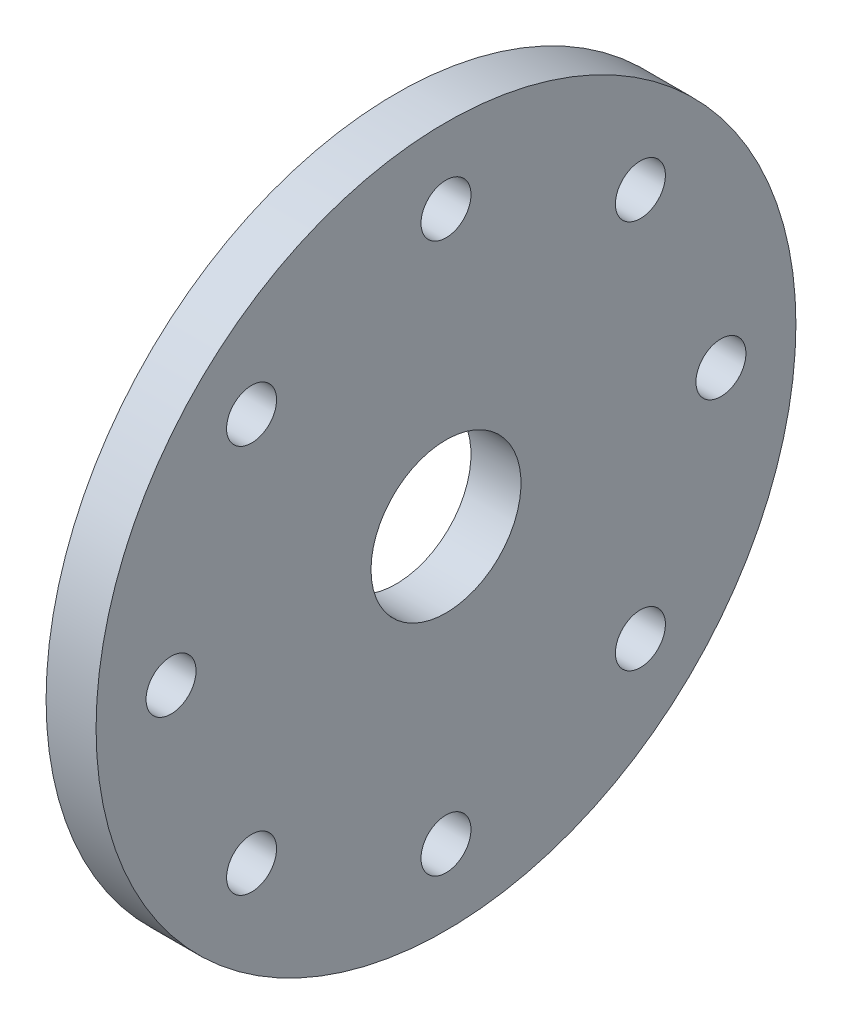
ISO-10303-21;
HEADER;
FILE_DESCRIPTION(('STEP AP214'),'2;1');
FILE_NAME('part.step','',(''),(''),'','','');
FILE_SCHEMA(('AUTOMOTIVE_DESIGN { 1 0 10303 214 1 1 1 1 }'));
ENDSEC;
DATA;
#1=APPLICATION_CONTEXT('core data for automotive mechanical design processes');
#2=APPLICATION_PROTOCOL_DEFINITION('international standard','automotive_design',2000,#1);
#3=PRODUCT_CONTEXT('',#1,'mechanical');
#4=PRODUCT('Part','Part','',(#3));
#5=PRODUCT_RELATED_PRODUCT_CATEGORY('part','',(#4));
#6=PRODUCT_DEFINITION_FORMATION('','',#4);
#7=PRODUCT_DEFINITION_CONTEXT('part definition',#1,'design');
#8=PRODUCT_DEFINITION('design','',#6,#7);
#9=PRODUCT_DEFINITION_SHAPE('','',#8);
#10=(LENGTH_UNIT() NAMED_UNIT(*) SI_UNIT(.MILLI.,.METRE.));
#11=(NAMED_UNIT(*) PLANE_ANGLE_UNIT() SI_UNIT($,.RADIAN.));
#12=(NAMED_UNIT(*) SI_UNIT($,.STERADIAN.) SOLID_ANGLE_UNIT());
#13=UNCERTAINTY_MEASURE_WITH_UNIT(LENGTH_MEASURE(1.E-05),#10,'distance_accuracy_value','');
#14=(GEOMETRIC_REPRESENTATION_CONTEXT(3) GLOBAL_UNCERTAINTY_ASSIGNED_CONTEXT((#13)) GLOBAL_UNIT_ASSIGNED_CONTEXT((#10,
#11,#12)) REPRESENTATION_CONTEXT('',''));
#15=CARTESIAN_POINT('',(0.,0.,0.));
#16=DIRECTION('',(0.,0.,1.));
#17=DIRECTION('',(1.,0.,0.));
#18=AXIS2_PLACEMENT_3D('',#15,#16,#17);
#19=CARTESIAN_POINT('',(-2.,3.,0.));
#20=DIRECTION('',(1.,0.,0.));
#21=DIRECTION('',(0.,0.,-1.));
#22=AXIS2_PLACEMENT_3D('',#19,#20,#21);
#23=PLANE('',#22);
#24=CARTESIAN_POINT('',(-2.,7.77817459305212,7.77817459305193));
#25=DIRECTION('',(1.,0.,0.));
#26=DIRECTION('',(0.,0.707106781186539,-0.707106781186556));
#27=AXIS2_PLACEMENT_3D('',#24,#25,#26);
#28=CIRCLE('',#27,1.);
#29=CARTESIAN_POINT('',(-2.,8.48528137423866,7.07106781186537));
#30=VERTEX_POINT('',#29);
#31=EDGE_CURVE('E73',#30,#30,#28,.T.);
#32=ORIENTED_EDGE('',*,*,#31,.T.);
#33=EDGE_LOOP('',(#32));
#34=FACE_BOUND('',#33,.T.);
#35=CARTESIAN_POINT('',(-2.,1.15218884181823E-13,11.));
#36=DIRECTION('',(1.,0.,0.));
#37=DIRECTION('',(0.,1.,0.));
#38=AXIS2_PLACEMENT_3D('',#35,#36,#37);
#39=CIRCLE('',#38,1.);
#40=CARTESIAN_POINT('',(-2.,1.00000000000012,11.));
#41=VERTEX_POINT('',#40);
#42=EDGE_CURVE('E67',#41,#41,#39,.T.);
#43=ORIENTED_EDGE('',*,*,#42,.T.);
#44=EDGE_LOOP('',(#43));
#45=FACE_BOUND('',#44,.T.);
#46=CARTESIAN_POINT('',(-2.,-7.77817459305195,7.77817459305209));
#47=DIRECTION('',(1.,0.,0.));
#48=DIRECTION('',(0.,0.707106781186554,0.707106781186541));
#49=AXIS2_PLACEMENT_3D('',#46,#47,#48);
#50=CIRCLE('',#49,1.);
#51=CARTESIAN_POINT('',(-2.,-7.0710678118654,8.48528137423863));
#52=VERTEX_POINT('',#51);
#53=EDGE_CURVE('E61',#52,#52,#50,.T.);
#54=ORIENTED_EDGE('',*,*,#53,.T.);
#55=EDGE_LOOP('',(#54));
#56=FACE_BOUND('',#55,.T.);
#57=CARTESIAN_POINT('',(-2.,-11.,0.));
#58=DIRECTION('',(1.,0.,0.));
#59=DIRECTION('',(0.,0.,1.));
#60=AXIS2_PLACEMENT_3D('',#57,#58,#59);
#61=CIRCLE('',#60,1.);
#62=CARTESIAN_POINT('',(-2.,-11.,1.));
#63=VERTEX_POINT('',#62);
#64=EDGE_CURVE('E55',#63,#63,#61,.T.);
#65=ORIENTED_EDGE('',*,*,#64,.T.);
#66=EDGE_LOOP('',(#65));
#67=FACE_BOUND('',#66,.T.);
#68=CARTESIAN_POINT('',(-2.,-7.77817459305206,-7.77817459305198));
#69=DIRECTION('',(1.,0.,0.));
#70=DIRECTION('',(0.,-0.707106781186544,0.707106781186551));
#71=AXIS2_PLACEMENT_3D('',#68,#69,#70);
#72=CIRCLE('',#71,1.);
#73=CARTESIAN_POINT('',(-2.,-8.48528137423861,-7.07106781186543));
#74=VERTEX_POINT('',#73);
#75=EDGE_CURVE('E49',#74,#74,#72,.T.);
#76=ORIENTED_EDGE('',*,*,#75,.T.);
#77=EDGE_LOOP('',(#76));
#78=FACE_BOUND('',#77,.T.);
#79=CARTESIAN_POINT('',(-2.,0.,-11.));
#80=DIRECTION('',(1.,0.,0.));
#81=DIRECTION('',(0.,-1.,0.));
#82=AXIS2_PLACEMENT_3D('',#79,#80,#81);
#83=CIRCLE('',#82,1.);
#84=CARTESIAN_POINT('',(-2.,-1.00000000000004,-11.));
#85=VERTEX_POINT('',#84);
#86=EDGE_CURVE('E43',#85,#85,#83,.T.);
#87=ORIENTED_EDGE('',*,*,#86,.T.);
#88=EDGE_LOOP('',(#87));
#89=FACE_BOUND('',#88,.T.);
#90=CARTESIAN_POINT('',(-2.,7.77817459305201,-7.77817459305204));
#91=DIRECTION('',(1.,0.,0.));
#92=DIRECTION('',(0.,-0.707106781186549,-0.707106781186546));
#93=AXIS2_PLACEMENT_3D('',#90,#91,#92);
#94=CIRCLE('',#93,1.);
#95=CARTESIAN_POINT('',(-2.,7.07106781186546,-8.48528137423859));
#96=VERTEX_POINT('',#95);
#97=EDGE_CURVE('E37',#96,#96,#94,.T.);
#98=ORIENTED_EDGE('',*,*,#97,.T.);
#99=EDGE_LOOP('',(#98));
#100=FACE_BOUND('',#99,.T.);
#101=CARTESIAN_POINT('',(-2.,11.,0.));
#102=DIRECTION('',(1.,0.,0.));
#103=DIRECTION('',(0.,0.,-1.));
#104=AXIS2_PLACEMENT_3D('',#101,#102,#103);
#105=CIRCLE('',#104,1.);
#106=CARTESIAN_POINT('',(-2.,11.,-1.));
#107=VERTEX_POINT('',#106);
#108=EDGE_CURVE('E33',#107,#107,#105,.T.);
#109=ORIENTED_EDGE('',*,*,#108,.T.);
#110=EDGE_LOOP('',(#109));
#111=FACE_BOUND('',#110,.T.);
#112=CARTESIAN_POINT('',(-2.,0.,0.));
#113=DIRECTION('',(-1.,0.,0.));
#114=DIRECTION('',(0.,0.,1.));
#115=AXIS2_PLACEMENT_3D('',#112,#113,#114);
#116=CIRCLE('',#115,3.);
#117=CARTESIAN_POINT('',(-2.,0.,3.));
#118=VERTEX_POINT('',#117);
#119=EDGE_CURVE('E28',#118,#118,#116,.T.);
#120=ORIENTED_EDGE('',*,*,#119,.F.);
#121=EDGE_LOOP('',(#120));
#122=FACE_BOUND('',#121,.T.);
#123=CARTESIAN_POINT('',(-2.,0.,0.));
#124=DIRECTION('',(-1.,0.,0.));
#125=DIRECTION('',(0.,0.,1.));
#126=AXIS2_PLACEMENT_3D('',#123,#124,#125);
#127=CIRCLE('',#126,14.);
#128=CARTESIAN_POINT('',(-2.,0.,14.));
#129=VERTEX_POINT('',#128);
#130=EDGE_CURVE('E10',#129,#129,#127,.T.);
#131=ORIENTED_EDGE('',*,*,#130,.T.);
#132=EDGE_LOOP('',(#131));
#133=FACE_BOUND('',#132,.T.);
#134=ADVANCED_FACE('F14',(#34,#45,#56,#67,#78,#89,#100,#111,#122,#133),#23,.F.);
#135=CARTESIAN_POINT('',(0.,0.,0.));
#136=DIRECTION('',(-1.,0.,0.));
#137=DIRECTION('',(0.,0.,1.));
#138=AXIS2_PLACEMENT_3D('',#135,#136,#137);
#139=CYLINDRICAL_SURFACE('',#138,14.);
#140=ORIENTED_EDGE('',*,*,#130,.F.);
#141=EDGE_LOOP('',(#140));
#142=FACE_BOUND('',#141,.T.);
#143=CARTESIAN_POINT('',(0.,0.,0.));
#144=DIRECTION('',(-1.,0.,0.));
#145=DIRECTION('',(0.,0.,1.));
#146=AXIS2_PLACEMENT_3D('',#143,#144,#145);
#147=CIRCLE('',#146,14.);
#148=CARTESIAN_POINT('',(0.,0.,14.));
#149=VERTEX_POINT('',#148);
#150=EDGE_CURVE('E20',#149,#149,#147,.T.);
#151=ORIENTED_EDGE('',*,*,#150,.T.);
#152=EDGE_LOOP('',(#151));
#153=FACE_BOUND('',#152,.T.);
#154=ADVANCED_FACE('F95',(#142,#153),#139,.T.);
#155=CARTESIAN_POINT('',(0.,14.,0.));
#156=DIRECTION('',(-1.,0.,0.));
#157=DIRECTION('',(0.,0.,1.));
#158=AXIS2_PLACEMENT_3D('',#155,#156,#157);
#159=PLANE('',#158);
#160=CARTESIAN_POINT('',(0.,7.77817459305212,7.77817459305193));
#161=DIRECTION('',(1.,0.,0.));
#162=DIRECTION('',(0.,0.707106781186539,-0.707106781186556));
#163=AXIS2_PLACEMENT_3D('',#160,#161,#162);
#164=CIRCLE('',#163,1.);
#165=CARTESIAN_POINT('',(0.,8.48528137423866,7.07106781186537));
#166=VERTEX_POINT('',#165);
#167=EDGE_CURVE('E76',#166,#166,#164,.T.);
#168=ORIENTED_EDGE('',*,*,#167,.F.);
#169=EDGE_LOOP('',(#168));
#170=FACE_BOUND('',#169,.T.);
#171=CARTESIAN_POINT('',(0.,1.15218884181823E-13,11.));
#172=DIRECTION('',(1.,0.,0.));
#173=DIRECTION('',(0.,1.,0.));
#174=AXIS2_PLACEMENT_3D('',#171,#172,#173);
#175=CIRCLE('',#174,1.);
#176=CARTESIAN_POINT('',(0.,1.00000000000012,11.));
#177=VERTEX_POINT('',#176);
#178=EDGE_CURVE('E70',#177,#177,#175,.T.);
#179=ORIENTED_EDGE('',*,*,#178,.F.);
#180=EDGE_LOOP('',(#179));
#181=FACE_BOUND('',#180,.T.);
#182=CARTESIAN_POINT('',(0.,-7.77817459305195,7.77817459305209));
#183=DIRECTION('',(1.,0.,0.));
#184=DIRECTION('',(0.,0.707106781186554,0.707106781186541));
#185=AXIS2_PLACEMENT_3D('',#182,#183,#184);
#186=CIRCLE('',#185,1.);
#187=CARTESIAN_POINT('',(0.,-7.0710678118654,8.48528137423863));
#188=VERTEX_POINT('',#187);
#189=EDGE_CURVE('E64',#188,#188,#186,.T.);
#190=ORIENTED_EDGE('',*,*,#189,.F.);
#191=EDGE_LOOP('',(#190));
#192=FACE_BOUND('',#191,.T.);
#193=CARTESIAN_POINT('',(0.,-11.,0.));
#194=DIRECTION('',(1.,0.,0.));
#195=DIRECTION('',(0.,0.,1.));
#196=AXIS2_PLACEMENT_3D('',#193,#194,#195);
#197=CIRCLE('',#196,1.);
#198=CARTESIAN_POINT('',(0.,-11.,1.));
#199=VERTEX_POINT('',#198);
#200=EDGE_CURVE('E58',#199,#199,#197,.T.);
#201=ORIENTED_EDGE('',*,*,#200,.F.);
#202=EDGE_LOOP('',(#201));
#203=FACE_BOUND('',#202,.T.);
#204=CARTESIAN_POINT('',(0.,-7.77817459305206,-7.77817459305198));
#205=DIRECTION('',(1.,0.,0.));
#206=DIRECTION('',(0.,-0.707106781186544,0.707106781186551));
#207=AXIS2_PLACEMENT_3D('',#204,#205,#206);
#208=CIRCLE('',#207,1.);
#209=CARTESIAN_POINT('',(0.,-8.48528137423861,-7.07106781186543));
#210=VERTEX_POINT('',#209);
#211=EDGE_CURVE('E52',#210,#210,#208,.T.);
#212=ORIENTED_EDGE('',*,*,#211,.F.);
#213=EDGE_LOOP('',(#212));
#214=FACE_BOUND('',#213,.T.);
#215=CARTESIAN_POINT('',(0.,0.,-11.));
#216=DIRECTION('',(1.,0.,0.));
#217=DIRECTION('',(0.,-1.,0.));
#218=AXIS2_PLACEMENT_3D('',#215,#216,#217);
#219=CIRCLE('',#218,1.);
#220=CARTESIAN_POINT('',(0.,-1.00000000000004,-11.));
#221=VERTEX_POINT('',#220);
#222=EDGE_CURVE('E46',#221,#221,#219,.T.);
#223=ORIENTED_EDGE('',*,*,#222,.F.);
#224=EDGE_LOOP('',(#223));
#225=FACE_BOUND('',#224,.T.);
#226=CARTESIAN_POINT('',(0.,7.77817459305201,-7.77817459305204));
#227=DIRECTION('',(1.,0.,0.));
#228=DIRECTION('',(0.,-0.707106781186549,-0.707106781186546));
#229=AXIS2_PLACEMENT_3D('',#226,#227,#228);
#230=CIRCLE('',#229,1.);
#231=CARTESIAN_POINT('',(0.,7.07106781186546,-8.48528137423859));
#232=VERTEX_POINT('',#231);
#233=EDGE_CURVE('E40',#232,#232,#230,.T.);
#234=ORIENTED_EDGE('',*,*,#233,.F.);
#235=EDGE_LOOP('',(#234));
#236=FACE_BOUND('',#235,.T.);
#237=CARTESIAN_POINT('',(0.,11.,0.));
#238=DIRECTION('',(1.,0.,0.));
#239=DIRECTION('',(0.,0.,-1.));
#240=AXIS2_PLACEMENT_3D('',#237,#238,#239);
#241=CIRCLE('',#240,1.);
#242=CARTESIAN_POINT('',(0.,11.,-1.));
#243=VERTEX_POINT('',#242);
#244=EDGE_CURVE('E34',#243,#243,#241,.T.);
#245=ORIENTED_EDGE('',*,*,#244,.F.);
#246=EDGE_LOOP('',(#245));
#247=FACE_BOUND('',#246,.T.);
#248=ORIENTED_EDGE('',*,*,#150,.F.);
#249=EDGE_LOOP('',(#248));
#250=FACE_BOUND('',#249,.T.);
#251=CARTESIAN_POINT('',(0.,0.,0.));
#252=DIRECTION('',(-1.,0.,0.));
#253=DIRECTION('',(0.,0.,1.));
#254=AXIS2_PLACEMENT_3D('',#251,#252,#253);
#255=CIRCLE('',#254,3.);
#256=CARTESIAN_POINT('',(0.,0.,3.));
#257=VERTEX_POINT('',#256);
#258=EDGE_CURVE('E24',#257,#257,#255,.T.);
#259=ORIENTED_EDGE('',*,*,#258,.T.);
#260=EDGE_LOOP('',(#259));
#261=FACE_BOUND('',#260,.T.);
#262=ADVANCED_FACE('F91',(#170,#181,#192,#203,#214,#225,#236,#247,#250,#261),#159,.F.);
#263=CARTESIAN_POINT('',(0.,0.,0.));
#264=DIRECTION('',(-1.,0.,0.));
#265=DIRECTION('',(0.,0.,1.));
#266=AXIS2_PLACEMENT_3D('',#263,#264,#265);
#267=CYLINDRICAL_SURFACE('',#266,3.);
#268=ORIENTED_EDGE('',*,*,#258,.F.);
#269=EDGE_LOOP('',(#268));
#270=FACE_BOUND('',#269,.T.);
#271=ORIENTED_EDGE('',*,*,#119,.T.);
#272=EDGE_LOOP('',(#271));
#273=FACE_BOUND('',#272,.T.);
#274=ADVANCED_FACE('F94',(#270,#273),#267,.F.);
#275=CARTESIAN_POINT('',(-2.,11.,0.));
#276=DIRECTION('',(1.,0.,0.));
#277=DIRECTION('',(0.,0.,-1.));
#278=AXIS2_PLACEMENT_3D('',#275,#276,#277);
#279=CYLINDRICAL_SURFACE('',#278,1.);
#280=ORIENTED_EDGE('',*,*,#108,.F.);
#281=EDGE_LOOP('',(#280));
#282=FACE_BOUND('',#281,.T.);
#283=ORIENTED_EDGE('',*,*,#244,.T.);
#284=EDGE_LOOP('',(#283));
#285=FACE_BOUND('',#284,.T.);
#286=ADVANCED_FACE('F116',(#282,#285),#279,.F.);
#287=CARTESIAN_POINT('',(-2.,7.77817459305201,-7.77817459305204));
#288=DIRECTION('',(1.,0.,0.));
#289=DIRECTION('',(0.,0.,-1.));
#290=AXIS2_PLACEMENT_3D('',#287,#288,#289);
#291=CYLINDRICAL_SURFACE('',#290,1.);
#292=ORIENTED_EDGE('',*,*,#97,.F.);
#293=EDGE_LOOP('',(#292));
#294=FACE_BOUND('',#293,.T.);
#295=ORIENTED_EDGE('',*,*,#233,.T.);
#296=EDGE_LOOP('',(#295));
#297=FACE_BOUND('',#296,.T.);
#298=ADVANCED_FACE('F133',(#294,#297),#291,.F.);
#299=CARTESIAN_POINT('',(-2.,0.,-11.));
#300=DIRECTION('',(1.,0.,0.));
#301=DIRECTION('',(0.,0.,-1.));
#302=AXIS2_PLACEMENT_3D('',#299,#300,#301);
#303=CYLINDRICAL_SURFACE('',#302,1.);
#304=ORIENTED_EDGE('',*,*,#86,.F.);
#305=EDGE_LOOP('',(#304));
#306=FACE_BOUND('',#305,.T.);
#307=ORIENTED_EDGE('',*,*,#222,.T.);
#308=EDGE_LOOP('',(#307));
#309=FACE_BOUND('',#308,.T.);
#310=ADVANCED_FACE('F137',(#306,#309),#303,.F.);
#311=CARTESIAN_POINT('',(-2.,-7.77817459305206,-7.77817459305198));
#312=DIRECTION('',(1.,0.,0.));
#313=DIRECTION('',(0.,0.,-1.));
#314=AXIS2_PLACEMENT_3D('',#311,#312,#313);
#315=CYLINDRICAL_SURFACE('',#314,1.);
#316=ORIENTED_EDGE('',*,*,#75,.F.);
#317=EDGE_LOOP('',(#316));
#318=FACE_BOUND('',#317,.T.);
#319=ORIENTED_EDGE('',*,*,#211,.T.);
#320=EDGE_LOOP('',(#319));
#321=FACE_BOUND('',#320,.T.);
#322=ADVANCED_FACE('F141',(#318,#321),#315,.F.);
#323=CARTESIAN_POINT('',(-2.,-11.,0.));
#324=DIRECTION('',(1.,0.,0.));
#325=DIRECTION('',(0.,0.,-1.));
#326=AXIS2_PLACEMENT_3D('',#323,#324,#325);
#327=CYLINDRICAL_SURFACE('',#326,1.);
#328=ORIENTED_EDGE('',*,*,#64,.F.);
#329=EDGE_LOOP('',(#328));
#330=FACE_BOUND('',#329,.T.);
#331=ORIENTED_EDGE('',*,*,#200,.T.);
#332=EDGE_LOOP('',(#331));
#333=FACE_BOUND('',#332,.T.);
#334=ADVANCED_FACE('F145',(#330,#333),#327,.F.);
#335=CARTESIAN_POINT('',(-2.,-7.77817459305195,7.77817459305209));
#336=DIRECTION('',(1.,0.,0.));
#337=DIRECTION('',(0.,0.,-1.));
#338=AXIS2_PLACEMENT_3D('',#335,#336,#337);
#339=CYLINDRICAL_SURFACE('',#338,1.);
#340=ORIENTED_EDGE('',*,*,#53,.F.);
#341=EDGE_LOOP('',(#340));
#342=FACE_BOUND('',#341,.T.);
#343=ORIENTED_EDGE('',*,*,#189,.T.);
#344=EDGE_LOOP('',(#343));
#345=FACE_BOUND('',#344,.T.);
#346=ADVANCED_FACE('F149',(#342,#345),#339,.F.);
#347=CARTESIAN_POINT('',(-2.,1.15218884181823E-13,11.));
#348=DIRECTION('',(1.,0.,0.));
#349=DIRECTION('',(0.,0.,-1.));
#350=AXIS2_PLACEMENT_3D('',#347,#348,#349);
#351=CYLINDRICAL_SURFACE('',#350,1.);
#352=ORIENTED_EDGE('',*,*,#42,.F.);
#353=EDGE_LOOP('',(#352));
#354=FACE_BOUND('',#353,.T.);
#355=ORIENTED_EDGE('',*,*,#178,.T.);
#356=EDGE_LOOP('',(#355));
#357=FACE_BOUND('',#356,.T.);
#358=ADVANCED_FACE('F87',(#354,#357),#351,.F.);
#359=CARTESIAN_POINT('',(-2.,7.77817459305212,7.77817459305193));
#360=DIRECTION('',(1.,0.,0.));
#361=DIRECTION('',(0.,0.,-1.));
#362=AXIS2_PLACEMENT_3D('',#359,#360,#361);
#363=CYLINDRICAL_SURFACE('',#362,1.);
#364=ORIENTED_EDGE('',*,*,#31,.F.);
#365=EDGE_LOOP('',(#364));
#366=FACE_BOUND('',#365,.T.);
#367=ORIENTED_EDGE('',*,*,#167,.T.);
#368=EDGE_LOOP('',(#367));
#369=FACE_BOUND('',#368,.T.);
#370=ADVANCED_FACE('F84',(#366,#369),#363,.F.);
#371=CLOSED_SHELL('',(#134,#154,#262,#274,#286,#298,#310,#322,#334,#346,#358,#370));
#372=MANIFOLD_SOLID_BREP('B1',#371);
#373=ADVANCED_BREP_SHAPE_REPRESENTATION('',(#18,#372),#14);
#374=SHAPE_DEFINITION_REPRESENTATION(#9,#373);
ENDSEC;
END-ISO-10303-21;
